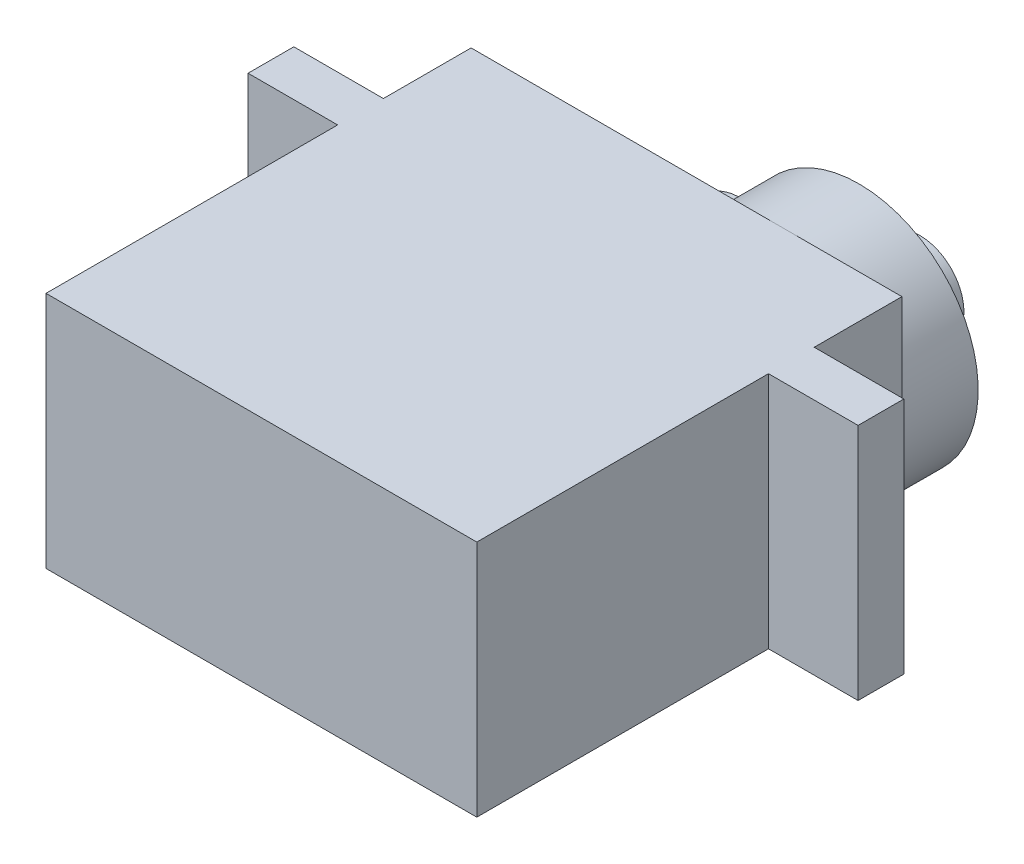
ISO-10303-21;
HEADER;
FILE_DESCRIPTION(('STEP AP214'),'2;1');
FILE_NAME('part.step','',(''),(''),'','','');
FILE_SCHEMA(('AUTOMOTIVE_DESIGN { 1 0 10303 214 1 1 1 1 }'));
ENDSEC;
DATA;
#1=APPLICATION_CONTEXT('core data for automotive mechanical design processes');
#2=APPLICATION_PROTOCOL_DEFINITION('international standard','automotive_design',2000,#1);
#3=PRODUCT_CONTEXT('',#1,'mechanical');
#4=PRODUCT('Part','Part','',(#3));
#5=PRODUCT_RELATED_PRODUCT_CATEGORY('part','',(#4));
#6=PRODUCT_DEFINITION_FORMATION('','',#4);
#7=PRODUCT_DEFINITION_CONTEXT('part definition',#1,'design');
#8=PRODUCT_DEFINITION('design','',#6,#7);
#9=PRODUCT_DEFINITION_SHAPE('','',#8);
#10=(LENGTH_UNIT() NAMED_UNIT(*) SI_UNIT(.MILLI.,.METRE.));
#11=(NAMED_UNIT(*) PLANE_ANGLE_UNIT() SI_UNIT($,.RADIAN.));
#12=(NAMED_UNIT(*) SI_UNIT($,.STERADIAN.) SOLID_ANGLE_UNIT());
#13=UNCERTAINTY_MEASURE_WITH_UNIT(LENGTH_MEASURE(1.E-05),#10,'distance_accuracy_value','');
#14=(GEOMETRIC_REPRESENTATION_CONTEXT(3) GLOBAL_UNCERTAINTY_ASSIGNED_CONTEXT((#13)) GLOBAL_UNIT_ASSIGNED_CONTEXT((#10,
#11,#12)) REPRESENTATION_CONTEXT('',''));
#15=CARTESIAN_POINT('',(0.,0.,0.));
#16=DIRECTION('',(0.,0.,1.));
#17=DIRECTION('',(1.,0.,0.));
#18=AXIS2_PLACEMENT_3D('',#15,#16,#17);
#19=CARTESIAN_POINT('',(0.,12.5,-22.3));
#20=DIRECTION('',(0.,0.,1.));
#21=DIRECTION('',(1.,0.,0.));
#22=AXIS2_PLACEMENT_3D('',#19,#20,#21);
#23=PLANE('',#22);
#24=CARTESIAN_POINT('',(10.1,6.25,-22.3));
#25=DIRECTION('',(0.,0.,-1.));
#26=DIRECTION('',(-1.,0.,0.));
#27=AXIS2_PLACEMENT_3D('',#24,#25,#26);
#28=CIRCLE('',#27,2.5);
#29=CARTESIAN_POINT('',(10.6,3.80051025721682,-22.3));
#30=VERTEX_POINT('',#29);
#31=CARTESIAN_POINT('',(10.6,8.69948974278318,-22.3));
#32=VERTEX_POINT('',#31);
#33=EDGE_CURVE('E177',#30,#32,#28,.T.);
#34=ORIENTED_EDGE('',*,*,#33,.F.);
#35=CARTESIAN_POINT('',(16.35,6.25,-22.3));
#36=DIRECTION('',(0.,0.,-1.));
#37=DIRECTION('',(-1.,0.,0.));
#38=AXIS2_PLACEMENT_3D('',#35,#36,#37);
#39=CIRCLE('',#38,6.25);
#40=CARTESIAN_POINT('',(16.35,0.,-22.3));
#41=VERTEX_POINT('',#40);
#42=EDGE_CURVE('E310',#41,#30,#39,.T.);
#43=ORIENTED_EDGE('',*,*,#42,.F.);
#44=DIRECTION('',(-1.,0.,0.));
#45=VECTOR('',#44,1.);
#46=CARTESIAN_POINT('',(0.,0.,-22.3));
#47=LINE('',#46,#45);
#48=CARTESIAN_POINT('',(0.,0.,-22.3));
#49=VERTEX_POINT('',#48);
#50=EDGE_CURVE('E247',#41,#49,#47,.T.);
#51=ORIENTED_EDGE('',*,*,#50,.T.);
#52=DIRECTION('',(0.,-1.,0.));
#53=VECTOR('',#52,1.);
#54=CARTESIAN_POINT('',(0.,12.5,-22.3));
#55=LINE('',#54,#53);
#56=CARTESIAN_POINT('',(0.,12.5,-22.3));
#57=VERTEX_POINT('',#56);
#58=EDGE_CURVE('E277',#57,#49,#55,.T.);
#59=ORIENTED_EDGE('',*,*,#58,.F.);
#60=DIRECTION('',(-1.,0.,0.));
#61=VECTOR('',#60,1.);
#62=CARTESIAN_POINT('',(0.,12.5,-22.3));
#63=LINE('',#62,#61);
#64=CARTESIAN_POINT('',(16.35,12.5,-22.3));
#65=VERTEX_POINT('',#64);
#66=EDGE_CURVE('E211',#65,#57,#63,.T.);
#67=ORIENTED_EDGE('',*,*,#66,.F.);
#68=EDGE_CURVE('E57',#32,#65,#39,.T.);
#69=ORIENTED_EDGE('',*,*,#68,.F.);
#70=EDGE_LOOP('',(#34,#43,#51,#59,#67,#69));
#71=FACE_BOUND('',#70,.T.);
#72=ADVANCED_FACE('F45',(#71),#23,.F.);
#73=CARTESIAN_POINT('',(22.6,6.25,-22.3));
#74=VERTEX_POINT('',#73);
#75=EDGE_CURVE('E11',#65,#74,#39,.T.);
#76=ORIENTED_EDGE('',*,*,#75,.F.);
#77=CARTESIAN_POINT('',(22.6,12.5,-22.3));
#78=VERTEX_POINT('',#77);
#79=EDGE_CURVE('E212',#78,#65,#63,.T.);
#80=ORIENTED_EDGE('',*,*,#79,.F.);
#81=DIRECTION('',(0.,-1.,0.));
#82=VECTOR('',#81,1.);
#83=CARTESIAN_POINT('',(22.6,12.5,-22.3));
#84=LINE('',#83,#82);
#85=EDGE_CURVE('E282',#78,#74,#84,.T.);
#86=ORIENTED_EDGE('',*,*,#85,.T.);
#87=EDGE_LOOP('',(#76,#80,#86));
#88=FACE_BOUND('',#87,.T.);
#89=ADVANCED_FACE('F341',(#88),#23,.F.);
#90=CARTESIAN_POINT('',(0.,12.5,0.));
#91=DIRECTION('',(1.,0.,0.));
#92=DIRECTION('',(0.,0.,-1.));
#93=AXIS2_PLACEMENT_3D('',#90,#91,#92);
#94=PLANE('',#93);
#95=DIRECTION('',(0.,0.,1.));
#96=VECTOR('',#95,1.);
#97=CARTESIAN_POINT('',(0.,0.,0.));
#98=LINE('',#97,#96);
#99=CARTESIAN_POINT('',(0.,0.,-15.3));
#100=VERTEX_POINT('',#99);
#101=CARTESIAN_POINT('',(0.,0.,0.));
#102=VERTEX_POINT('',#101);
#103=EDGE_CURVE('E179',#100,#102,#98,.T.);
#104=ORIENTED_EDGE('',*,*,#103,.T.);
#105=DIRECTION('',(0.,-1.,0.));
#106=VECTOR('',#105,1.);
#107=CARTESIAN_POINT('',(0.,12.5,0.));
#108=LINE('',#107,#106);
#109=CARTESIAN_POINT('',(0.,12.5,0.));
#110=VERTEX_POINT('',#109);
#111=EDGE_CURVE('E49',#110,#102,#108,.T.);
#112=ORIENTED_EDGE('',*,*,#111,.F.);
#113=DIRECTION('',(0.,0.,1.));
#114=VECTOR('',#113,1.);
#115=CARTESIAN_POINT('',(0.,12.5,0.));
#116=LINE('',#115,#114);
#117=CARTESIAN_POINT('',(0.,12.5,-15.3));
#118=VERTEX_POINT('',#117);
#119=EDGE_CURVE('E188',#118,#110,#116,.T.);
#120=ORIENTED_EDGE('',*,*,#119,.F.);
#121=DIRECTION('',(0.,-1.,0.));
#122=VECTOR('',#121,1.);
#123=CARTESIAN_POINT('',(0.,12.5,-15.3));
#124=LINE('',#123,#122);
#125=EDGE_CURVE('E227',#118,#100,#124,.T.);
#126=ORIENTED_EDGE('',*,*,#125,.T.);
#127=EDGE_LOOP('',(#104,#112,#120,#126));
#128=FACE_BOUND('',#127,.T.);
#129=ADVANCED_FACE('F47',(#128),#94,.F.);
#130=CARTESIAN_POINT('',(0.,12.5,0.));
#131=DIRECTION('',(0.,0.,-1.));
#132=DIRECTION('',(-1.,0.,0.));
#133=AXIS2_PLACEMENT_3D('',#130,#131,#132);
#134=PLANE('',#133);
#135=DIRECTION('',(1.,0.,0.));
#136=VECTOR('',#135,1.);
#137=CARTESIAN_POINT('',(0.,0.,0.));
#138=LINE('',#137,#136);
#139=CARTESIAN_POINT('',(22.6,0.,0.));
#140=VERTEX_POINT('',#139);
#141=EDGE_CURVE('E184',#102,#140,#138,.T.);
#142=ORIENTED_EDGE('',*,*,#141,.T.);
#143=DIRECTION('',(0.,-1.,0.));
#144=VECTOR('',#143,1.);
#145=CARTESIAN_POINT('',(22.6,12.5,0.));
#146=LINE('',#145,#144);
#147=CARTESIAN_POINT('',(22.6,12.5,0.));
#148=VERTEX_POINT('',#147);
#149=EDGE_CURVE('E301',#148,#140,#146,.T.);
#150=ORIENTED_EDGE('',*,*,#149,.F.);
#151=DIRECTION('',(1.,0.,0.));
#152=VECTOR('',#151,1.);
#153=CARTESIAN_POINT('',(0.,12.5,0.));
#154=LINE('',#153,#152);
#155=EDGE_CURVE('E192',#110,#148,#154,.T.);
#156=ORIENTED_EDGE('',*,*,#155,.F.);
#157=ORIENTED_EDGE('',*,*,#111,.T.);
#158=EDGE_LOOP('',(#142,#150,#156,#157));
#159=FACE_BOUND('',#158,.T.);
#160=ADVANCED_FACE('F377',(#159),#134,.F.);
#161=CARTESIAN_POINT('',(22.6,12.5,0.));
#162=DIRECTION('',(-1.,0.,0.));
#163=DIRECTION('',(0.,0.,1.));
#164=AXIS2_PLACEMENT_3D('',#161,#162,#163);
#165=PLANE('',#164);
#166=DIRECTION('',(0.,0.,-1.));
#167=VECTOR('',#166,1.);
#168=CARTESIAN_POINT('',(22.6,0.,0.));
#169=LINE('',#168,#167);
#170=CARTESIAN_POINT('',(22.6,0.,-15.3));
#171=VERTEX_POINT('',#170);
#172=EDGE_CURVE('E231',#140,#171,#169,.T.);
#173=ORIENTED_EDGE('',*,*,#172,.T.);
#174=DIRECTION('',(0.,-1.,0.));
#175=VECTOR('',#174,1.);
#176=CARTESIAN_POINT('',(22.6,12.5,-15.3));
#177=LINE('',#176,#175);
#178=CARTESIAN_POINT('',(22.6,12.5,-15.3));
#179=VERTEX_POINT('',#178);
#180=EDGE_CURVE('E298',#179,#171,#177,.T.);
#181=ORIENTED_EDGE('',*,*,#180,.F.);
#182=DIRECTION('',(0.,0.,-1.));
#183=VECTOR('',#182,1.);
#184=CARTESIAN_POINT('',(22.6,12.5,0.));
#185=LINE('',#184,#183);
#186=EDGE_CURVE('E196',#148,#179,#185,.T.);
#187=ORIENTED_EDGE('',*,*,#186,.F.);
#188=ORIENTED_EDGE('',*,*,#149,.T.);
#189=EDGE_LOOP('',(#173,#181,#187,#188));
#190=FACE_BOUND('',#189,.T.);
#191=ADVANCED_FACE('F374',(#190),#165,.F.);
#192=CARTESIAN_POINT('',(22.6,12.5,-15.3));
#193=DIRECTION('',(0.,0.,-1.));
#194=DIRECTION('',(-1.,0.,0.));
#195=AXIS2_PLACEMENT_3D('',#192,#193,#194);
#196=PLANE('',#195);
#197=DIRECTION('',(1.,0.,0.));
#198=VECTOR('',#197,1.);
#199=CARTESIAN_POINT('',(22.6,0.,-15.3));
#200=LINE('',#199,#198);
#201=CARTESIAN_POINT('',(27.3,0.,-15.3));
#202=VERTEX_POINT('',#201);
#203=EDGE_CURVE('E234',#171,#202,#200,.T.);
#204=ORIENTED_EDGE('',*,*,#203,.T.);
#205=DIRECTION('',(0.,-1.,0.));
#206=VECTOR('',#205,1.);
#207=CARTESIAN_POINT('',(27.3,12.5,-15.3));
#208=LINE('',#207,#206);
#209=CARTESIAN_POINT('',(27.3,12.5,-15.3));
#210=VERTEX_POINT('',#209);
#211=EDGE_CURVE('E294',#210,#202,#208,.T.);
#212=ORIENTED_EDGE('',*,*,#211,.F.);
#213=DIRECTION('',(1.,0.,0.));
#214=VECTOR('',#213,1.);
#215=CARTESIAN_POINT('',(22.6,12.5,-15.3));
#216=LINE('',#215,#214);
#217=EDGE_CURVE('E199',#179,#210,#216,.T.);
#218=ORIENTED_EDGE('',*,*,#217,.F.);
#219=ORIENTED_EDGE('',*,*,#180,.T.);
#220=EDGE_LOOP('',(#204,#212,#218,#219));
#221=FACE_BOUND('',#220,.T.);
#222=ADVANCED_FACE('F370',(#221),#196,.F.);
#223=CARTESIAN_POINT('',(27.3,12.5,-17.7));
#224=DIRECTION('',(-1.,0.,0.));
#225=DIRECTION('',(0.,0.,1.));
#226=AXIS2_PLACEMENT_3D('',#223,#224,#225);
#227=PLANE('',#226);
#228=DIRECTION('',(0.,0.,-1.));
#229=VECTOR('',#228,1.);
#230=CARTESIAN_POINT('',(27.3,0.,-17.7));
#231=LINE('',#230,#229);
#232=CARTESIAN_POINT('',(27.3,0.,-17.7));
#233=VERTEX_POINT('',#232);
#234=EDGE_CURVE('E237',#202,#233,#231,.T.);
#235=ORIENTED_EDGE('',*,*,#234,.T.);
#236=DIRECTION('',(0.,-1.,0.));
#237=VECTOR('',#236,1.);
#238=CARTESIAN_POINT('',(27.3,12.5,-17.7));
#239=LINE('',#238,#237);
#240=CARTESIAN_POINT('',(27.3,12.5,-17.7));
#241=VERTEX_POINT('',#240);
#242=EDGE_CURVE('E290',#241,#233,#239,.T.);
#243=ORIENTED_EDGE('',*,*,#242,.F.);
#244=DIRECTION('',(0.,0.,-1.));
#245=VECTOR('',#244,1.);
#246=CARTESIAN_POINT('',(27.3,12.5,-17.7));
#247=LINE('',#246,#245);
#248=EDGE_CURVE('E202',#210,#241,#247,.T.);
#249=ORIENTED_EDGE('',*,*,#248,.F.);
#250=ORIENTED_EDGE('',*,*,#211,.T.);
#251=EDGE_LOOP('',(#235,#243,#249,#250));
#252=FACE_BOUND('',#251,.T.);
#253=ADVANCED_FACE('F364',(#252),#227,.F.);
#254=CARTESIAN_POINT('',(22.6,12.5,-17.7));
#255=DIRECTION('',(0.,0.,1.));
#256=DIRECTION('',(1.,0.,0.));
#257=AXIS2_PLACEMENT_3D('',#254,#255,#256);
#258=PLANE('',#257);
#259=DIRECTION('',(-1.,0.,0.));
#260=VECTOR('',#259,1.);
#261=CARTESIAN_POINT('',(22.6,0.,-17.7));
#262=LINE('',#261,#260);
#263=CARTESIAN_POINT('',(22.6,0.,-17.7));
#264=VERTEX_POINT('',#263);
#265=EDGE_CURVE('E240',#233,#264,#262,.T.);
#266=ORIENTED_EDGE('',*,*,#265,.T.);
#267=DIRECTION('',(0.,-1.,0.));
#268=VECTOR('',#267,1.);
#269=CARTESIAN_POINT('',(22.6,12.5,-17.7));
#270=LINE('',#269,#268);
#271=CARTESIAN_POINT('',(22.6,12.5,-17.7));
#272=VERTEX_POINT('',#271);
#273=EDGE_CURVE('E286',#272,#264,#270,.T.);
#274=ORIENTED_EDGE('',*,*,#273,.F.);
#275=DIRECTION('',(-1.,0.,0.));
#276=VECTOR('',#275,1.);
#277=CARTESIAN_POINT('',(22.6,12.5,-17.7));
#278=LINE('',#277,#276);
#279=EDGE_CURVE('E205',#241,#272,#278,.T.);
#280=ORIENTED_EDGE('',*,*,#279,.F.);
#281=ORIENTED_EDGE('',*,*,#242,.T.);
#282=EDGE_LOOP('',(#266,#274,#280,#281));
#283=FACE_BOUND('',#282,.T.);
#284=ADVANCED_FACE('F359',(#283),#258,.F.);
#285=CARTESIAN_POINT('',(22.6,12.5,-17.7));
#286=DIRECTION('',(-1.,0.,0.));
#287=DIRECTION('',(0.,0.,1.));
#288=AXIS2_PLACEMENT_3D('',#285,#286,#287);
#289=PLANE('',#288);
#290=DIRECTION('',(0.,0.,-1.));
#291=VECTOR('',#290,1.);
#292=CARTESIAN_POINT('',(22.6,0.,-17.7));
#293=LINE('',#292,#291);
#294=CARTESIAN_POINT('',(22.6,0.,-22.3));
#295=VERTEX_POINT('',#294);
#296=EDGE_CURVE('E243',#264,#295,#293,.T.);
#297=ORIENTED_EDGE('',*,*,#296,.T.);
#298=EDGE_CURVE('E281',#74,#295,#84,.T.);
#299=ORIENTED_EDGE('',*,*,#298,.F.);
#300=ORIENTED_EDGE('',*,*,#85,.F.);
#301=DIRECTION('',(0.,0.,-1.));
#302=VECTOR('',#301,1.);
#303=CARTESIAN_POINT('',(22.6,12.5,-17.7));
#304=LINE('',#303,#302);
#305=EDGE_CURVE('E208',#272,#78,#304,.T.);
#306=ORIENTED_EDGE('',*,*,#305,.F.);
#307=ORIENTED_EDGE('',*,*,#273,.T.);
#308=EDGE_LOOP('',(#297,#299,#300,#306,#307));
#309=FACE_BOUND('',#308,.T.);
#310=ADVANCED_FACE('F352',(#309),#289,.F.);
#311=EDGE_CURVE('E55',#74,#41,#39,.T.);
#312=ORIENTED_EDGE('',*,*,#311,.F.);
#313=ORIENTED_EDGE('',*,*,#298,.T.);
#314=EDGE_CURVE('E248',#295,#41,#47,.T.);
#315=ORIENTED_EDGE('',*,*,#314,.T.);
#316=EDGE_LOOP('',(#312,#313,#315));
#317=FACE_BOUND('',#316,.T.);
#318=ADVANCED_FACE('F343',(#317),#23,.F.);
#319=CARTESIAN_POINT('',(0.,12.5,-17.7));
#320=DIRECTION('',(1.,0.,0.));
#321=DIRECTION('',(0.,0.,-1.));
#322=AXIS2_PLACEMENT_3D('',#319,#320,#321);
#323=PLANE('',#322);
#324=DIRECTION('',(0.,0.,1.));
#325=VECTOR('',#324,1.);
#326=CARTESIAN_POINT('',(0.,0.,-17.7));
#327=LINE('',#326,#325);
#328=CARTESIAN_POINT('',(0.,0.,-17.7));
#329=VERTEX_POINT('',#328);
#330=EDGE_CURVE('E251',#49,#329,#327,.T.);
#331=ORIENTED_EDGE('',*,*,#330,.T.);
#332=DIRECTION('',(0.,-1.,0.));
#333=VECTOR('',#332,1.);
#334=CARTESIAN_POINT('',(0.,12.5,-17.7));
#335=LINE('',#334,#333);
#336=CARTESIAN_POINT('',(0.,12.5,-17.7));
#337=VERTEX_POINT('',#336);
#338=EDGE_CURVE('E273',#337,#329,#335,.T.);
#339=ORIENTED_EDGE('',*,*,#338,.F.);
#340=DIRECTION('',(0.,0.,1.));
#341=VECTOR('',#340,1.);
#342=CARTESIAN_POINT('',(0.,12.5,-17.7));
#343=LINE('',#342,#341);
#344=EDGE_CURVE('E216',#57,#337,#343,.T.);
#345=ORIENTED_EDGE('',*,*,#344,.F.);
#346=ORIENTED_EDGE('',*,*,#58,.T.);
#347=EDGE_LOOP('',(#331,#339,#345,#346));
#348=FACE_BOUND('',#347,.T.);
#349=ADVANCED_FACE('F351',(#348),#323,.F.);
#350=CARTESIAN_POINT('',(-4.7,12.5,-17.7));
#351=DIRECTION('',(0.,0.,1.));
#352=DIRECTION('',(1.,0.,0.));
#353=AXIS2_PLACEMENT_3D('',#350,#351,#352);
#354=PLANE('',#353);
#355=DIRECTION('',(-1.,0.,0.));
#356=VECTOR('',#355,1.);
#357=CARTESIAN_POINT('',(-4.7,0.,-17.7));
#358=LINE('',#357,#356);
#359=CARTESIAN_POINT('',(-4.7,0.,-17.7));
#360=VERTEX_POINT('',#359);
#361=EDGE_CURVE('E254',#329,#360,#358,.T.);
#362=ORIENTED_EDGE('',*,*,#361,.T.);
#363=DIRECTION('',(0.,-1.,0.));
#364=VECTOR('',#363,1.);
#365=CARTESIAN_POINT('',(-4.7,12.5,-17.7));
#366=LINE('',#365,#364);
#367=CARTESIAN_POINT('',(-4.7,12.5,-17.7));
#368=VERTEX_POINT('',#367);
#369=EDGE_CURVE('E269',#368,#360,#366,.T.);
#370=ORIENTED_EDGE('',*,*,#369,.F.);
#371=DIRECTION('',(-1.,0.,0.));
#372=VECTOR('',#371,1.);
#373=CARTESIAN_POINT('',(-4.7,12.5,-17.7));
#374=LINE('',#373,#372);
#375=EDGE_CURVE('E219',#337,#368,#374,.T.);
#376=ORIENTED_EDGE('',*,*,#375,.F.);
#377=ORIENTED_EDGE('',*,*,#338,.T.);
#378=EDGE_LOOP('',(#362,#370,#376,#377));
#379=FACE_BOUND('',#378,.T.);
#380=ADVANCED_FACE('F357',(#379),#354,.F.);
#381=CARTESIAN_POINT('',(-4.7,12.5,-17.7));
#382=DIRECTION('',(1.,0.,0.));
#383=DIRECTION('',(0.,0.,-1.));
#384=AXIS2_PLACEMENT_3D('',#381,#382,#383);
#385=PLANE('',#384);
#386=DIRECTION('',(0.,0.,1.));
#387=VECTOR('',#386,1.);
#388=CARTESIAN_POINT('',(-4.7,0.,-17.7));
#389=LINE('',#388,#387);
#390=CARTESIAN_POINT('',(-4.7,0.,-15.3));
#391=VERTEX_POINT('',#390);
#392=EDGE_CURVE('E257',#360,#391,#389,.T.);
#393=ORIENTED_EDGE('',*,*,#392,.T.);
#394=DIRECTION('',(0.,-1.,0.));
#395=VECTOR('',#394,1.);
#396=CARTESIAN_POINT('',(-4.7,12.5,-15.3));
#397=LINE('',#396,#395);
#398=CARTESIAN_POINT('',(-4.7,12.5,-15.3));
#399=VERTEX_POINT('',#398);
#400=EDGE_CURVE('E265',#399,#391,#397,.T.);
#401=ORIENTED_EDGE('',*,*,#400,.F.);
#402=DIRECTION('',(0.,0.,1.));
#403=VECTOR('',#402,1.);
#404=CARTESIAN_POINT('',(-4.7,12.5,-17.7));
#405=LINE('',#404,#403);
#406=EDGE_CURVE('E222',#368,#399,#405,.T.);
#407=ORIENTED_EDGE('',*,*,#406,.F.);
#408=ORIENTED_EDGE('',*,*,#369,.T.);
#409=EDGE_LOOP('',(#393,#401,#407,#408));
#410=FACE_BOUND('',#409,.T.);
#411=ADVANCED_FACE('F406',(#410),#385,.F.);
#412=CARTESIAN_POINT('',(-4.7,12.5,-15.3));
#413=DIRECTION('',(0.,0.,-1.));
#414=DIRECTION('',(-1.,0.,0.));
#415=AXIS2_PLACEMENT_3D('',#412,#413,#414);
#416=PLANE('',#415);
#417=DIRECTION('',(1.,0.,0.));
#418=VECTOR('',#417,1.);
#419=CARTESIAN_POINT('',(-4.7,0.,-15.3));
#420=LINE('',#419,#418);
#421=EDGE_CURVE('E193',#391,#100,#420,.T.);
#422=ORIENTED_EDGE('',*,*,#421,.T.);
#423=ORIENTED_EDGE('',*,*,#125,.F.);
#424=DIRECTION('',(1.,0.,0.));
#425=VECTOR('',#424,1.);
#426=CARTESIAN_POINT('',(-4.7,12.5,-15.3));
#427=LINE('',#426,#425);
#428=EDGE_CURVE('E225',#399,#118,#427,.T.);
#429=ORIENTED_EDGE('',*,*,#428,.F.);
#430=ORIENTED_EDGE('',*,*,#400,.T.);
#431=EDGE_LOOP('',(#422,#423,#429,#430));
#432=FACE_BOUND('',#431,.T.);
#433=ADVANCED_FACE('F400',(#432),#416,.F.);
#434=CARTESIAN_POINT('',(0.,12.5,0.));
#435=DIRECTION('',(0.,-1.,0.));
#436=DIRECTION('',(0.,0.,-1.));
#437=AXIS2_PLACEMENT_3D('',#434,#435,#436);
#438=PLANE('',#437);
#439=ORIENTED_EDGE('',*,*,#119,.T.);
#440=ORIENTED_EDGE('',*,*,#155,.T.);
#441=ORIENTED_EDGE('',*,*,#186,.T.);
#442=ORIENTED_EDGE('',*,*,#217,.T.);
#443=ORIENTED_EDGE('',*,*,#248,.T.);
#444=ORIENTED_EDGE('',*,*,#279,.T.);
#445=ORIENTED_EDGE('',*,*,#305,.T.);
#446=ORIENTED_EDGE('',*,*,#79,.T.);
#447=ORIENTED_EDGE('',*,*,#66,.T.);
#448=ORIENTED_EDGE('',*,*,#344,.T.);
#449=ORIENTED_EDGE('',*,*,#375,.T.);
#450=ORIENTED_EDGE('',*,*,#406,.T.);
#451=ORIENTED_EDGE('',*,*,#428,.T.);
#452=EDGE_LOOP('',(#439,#440,#441,#442,#443,#444,#445,#446,#447,#448,#449,#450,#451));
#453=FACE_BOUND('',#452,.T.);
#454=ADVANCED_FACE('F394',(#453),#438,.F.);
#455=CARTESIAN_POINT('',(0.,0.,0.));
#456=DIRECTION('',(0.,-1.,0.));
#457=DIRECTION('',(0.,0.,-1.));
#458=AXIS2_PLACEMENT_3D('',#455,#456,#457);
#459=PLANE('',#458);
#460=ORIENTED_EDGE('',*,*,#103,.F.);
#461=ORIENTED_EDGE('',*,*,#421,.F.);
#462=ORIENTED_EDGE('',*,*,#392,.F.);
#463=ORIENTED_EDGE('',*,*,#361,.F.);
#464=ORIENTED_EDGE('',*,*,#330,.F.);
#465=ORIENTED_EDGE('',*,*,#50,.F.);
#466=ORIENTED_EDGE('',*,*,#314,.F.);
#467=ORIENTED_EDGE('',*,*,#296,.F.);
#468=ORIENTED_EDGE('',*,*,#265,.F.);
#469=ORIENTED_EDGE('',*,*,#234,.F.);
#470=ORIENTED_EDGE('',*,*,#203,.F.);
#471=ORIENTED_EDGE('',*,*,#172,.F.);
#472=ORIENTED_EDGE('',*,*,#141,.F.);
#473=EDGE_LOOP('',(#460,#461,#462,#463,#464,#465,#466,#467,#468,#469,#470,#471,#472));
#474=FACE_BOUND('',#473,.T.);
#475=ADVANCED_FACE('F385',(#474),#459,.T.);
#476=CARTESIAN_POINT('',(10.1,6.25,-26.3));
#477=DIRECTION('',(0.,0.,1.));
#478=DIRECTION('',(1.,0.,0.));
#479=AXIS2_PLACEMENT_3D('',#476,#477,#478);
#480=CYLINDRICAL_SURFACE('',#479,2.5);
#481=ORIENTED_EDGE('',*,*,#33,.T.);
#482=DIRECTION('',(0.,0.,1.));
#483=VECTOR('',#482,1.);
#484=CARTESIAN_POINT('',(10.6,8.69948974278318,-26.3));
#485=LINE('',#484,#483);
#486=CARTESIAN_POINT('',(10.6,8.69948974278318,-26.3));
#487=VERTEX_POINT('',#486);
#488=EDGE_CURVE('E162',#487,#32,#485,.T.);
#489=ORIENTED_EDGE('',*,*,#488,.F.);
#490=CARTESIAN_POINT('',(10.1,6.25,-26.3));
#491=DIRECTION('',(0.,0.,-1.));
#492=DIRECTION('',(-1.,0.,0.));
#493=AXIS2_PLACEMENT_3D('',#490,#491,#492);
#494=CIRCLE('',#493,2.5);
#495=CARTESIAN_POINT('',(10.6,3.80051025721682,-26.3));
#496=VERTEX_POINT('',#495);
#497=EDGE_CURVE('E170',#496,#487,#494,.T.);
#498=ORIENTED_EDGE('',*,*,#497,.F.);
#499=DIRECTION('',(0.,0.,1.));
#500=VECTOR('',#499,1.);
#501=CARTESIAN_POINT('',(10.6,3.80051025721682,-26.3));
#502=LINE('',#501,#500);
#503=EDGE_CURVE('E166',#496,#30,#502,.T.);
#504=ORIENTED_EDGE('',*,*,#503,.T.);
#505=EDGE_LOOP('',(#481,#489,#498,#504));
#506=FACE_BOUND('',#505,.T.);
#507=ADVANCED_FACE('F176',(#506),#480,.T.);
#508=CARTESIAN_POINT('',(16.35,6.25,-26.3));
#509=DIRECTION('',(0.,0.,1.));
#510=DIRECTION('',(1.,0.,0.));
#511=AXIS2_PLACEMENT_3D('',#508,#509,#510);
#512=CYLINDRICAL_SURFACE('',#511,6.25);
#513=ORIENTED_EDGE('',*,*,#68,.T.);
#514=ORIENTED_EDGE('',*,*,#75,.T.);
#515=ORIENTED_EDGE('',*,*,#311,.T.);
#516=ORIENTED_EDGE('',*,*,#42,.T.);
#517=ORIENTED_EDGE('',*,*,#503,.F.);
#518=CARTESIAN_POINT('',(16.35,6.25,-26.3));
#519=DIRECTION('',(0.,0.,-1.));
#520=DIRECTION('',(-1.,0.,0.));
#521=AXIS2_PLACEMENT_3D('',#518,#519,#520);
#522=CIRCLE('',#521,6.25);
#523=EDGE_CURVE('E158',#487,#496,#522,.T.);
#524=ORIENTED_EDGE('',*,*,#523,.F.);
#525=ORIENTED_EDGE('',*,*,#488,.T.);
#526=EDGE_LOOP('',(#513,#514,#515,#516,#517,#524,#525));
#527=FACE_BOUND('',#526,.T.);
#528=ADVANCED_FACE('F160',(#527),#512,.T.);
#529=CARTESIAN_POINT('',(13.225,6.25,-26.3));
#530=DIRECTION('',(0.,0.,-1.));
#531=DIRECTION('',(-1.,0.,0.));
#532=AXIS2_PLACEMENT_3D('',#529,#530,#531);
#533=PLANE('',#532);
#534=CARTESIAN_POINT('',(16.35,6.25,-26.3));
#535=DIRECTION('',(0.,0.,-1.));
#536=DIRECTION('',(-1.,0.,0.));
#537=AXIS2_PLACEMENT_3D('',#534,#535,#536);
#538=CIRCLE('',#537,2.3);
#539=CARTESIAN_POINT('',(14.05,6.25,-26.3));
#540=VERTEX_POINT('',#539);
#541=EDGE_CURVE('E321',#540,#540,#538,.T.);
#542=ORIENTED_EDGE('',*,*,#541,.F.);
#543=EDGE_LOOP('',(#542));
#544=FACE_BOUND('',#543,.T.);
#545=ORIENTED_EDGE('',*,*,#497,.T.);
#546=ORIENTED_EDGE('',*,*,#523,.T.);
#547=EDGE_LOOP('',(#545,#546));
#548=FACE_BOUND('',#547,.T.);
#549=ADVANCED_FACE('F172',(#544,#548),#533,.T.);
#550=CARTESIAN_POINT('',(16.35,6.25,-29.5));
#551=DIRECTION('',(0.,0.,1.));
#552=DIRECTION('',(1.,0.,0.));
#553=AXIS2_PLACEMENT_3D('',#550,#551,#552);
#554=CYLINDRICAL_SURFACE('',#553,2.3);
#555=CARTESIAN_POINT('',(16.35,6.25,-29.5));
#556=DIRECTION('',(0.,0.,-1.));
#557=DIRECTION('',(-1.,0.,0.));
#558=AXIS2_PLACEMENT_3D('',#555,#556,#557);
#559=CIRCLE('',#558,2.3);
#560=CARTESIAN_POINT('',(14.05,6.25,-29.5));
#561=VERTEX_POINT('',#560);
#562=EDGE_CURVE('E318',#561,#561,#559,.T.);
#563=ORIENTED_EDGE('',*,*,#562,.F.);
#564=EDGE_LOOP('',(#563));
#565=FACE_BOUND('',#564,.T.);
#566=ORIENTED_EDGE('',*,*,#541,.T.);
#567=EDGE_LOOP('',(#566));
#568=FACE_BOUND('',#567,.T.);
#569=ADVANCED_FACE('F328',(#565,#568),#554,.T.);
#570=CARTESIAN_POINT('',(16.35,6.25,-29.5));
#571=DIRECTION('',(0.,0.,-1.));
#572=DIRECTION('',(-1.,0.,0.));
#573=AXIS2_PLACEMENT_3D('',#570,#571,#572);
#574=PLANE('',#573);
#575=ORIENTED_EDGE('',*,*,#562,.T.);
#576=EDGE_LOOP('',(#575));
#577=FACE_BOUND('',#576,.T.);
#578=ADVANCED_FACE('F336',(#577),#574,.T.);
#579=CLOSED_SHELL('',(#72,#89,#129,#160,#191,#222,#253,#284,#310,#318,#349,#380,#411,#433,#454,
#475,#507,#528,#549,#569,#578));
#580=MANIFOLD_SOLID_BREP('B2',#579);
#581=ADVANCED_BREP_SHAPE_REPRESENTATION('',(#18,#580),#14);
#582=SHAPE_DEFINITION_REPRESENTATION(#9,#581);
ENDSEC;
END-ISO-10303-21;
